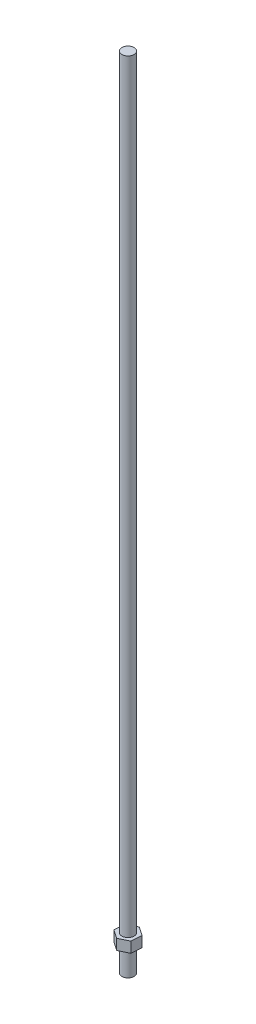
ISO-10303-21;
HEADER;
FILE_DESCRIPTION(('STEP AP214'),'2;1');
FILE_NAME('part.step','',(''),(''),'','','');
FILE_SCHEMA(('AUTOMOTIVE_DESIGN { 1 0 10303 214 1 1 1 1 }'));
ENDSEC;
DATA;
#1=APPLICATION_CONTEXT('core data for automotive mechanical design processes');
#2=APPLICATION_PROTOCOL_DEFINITION('international standard','automotive_design',2000,#1);
#3=PRODUCT_CONTEXT('',#1,'mechanical');
#4=PRODUCT('Part','Part','',(#3));
#5=PRODUCT_RELATED_PRODUCT_CATEGORY('part','',(#4));
#6=PRODUCT_DEFINITION_FORMATION('','',#4);
#7=PRODUCT_DEFINITION_CONTEXT('part definition',#1,'design');
#8=PRODUCT_DEFINITION('design','',#6,#7);
#9=PRODUCT_DEFINITION_SHAPE('','',#8);
#10=(LENGTH_UNIT() NAMED_UNIT(*) SI_UNIT(.MILLI.,.METRE.));
#11=(NAMED_UNIT(*) PLANE_ANGLE_UNIT() SI_UNIT($,.RADIAN.));
#12=(NAMED_UNIT(*) SI_UNIT($,.STERADIAN.) SOLID_ANGLE_UNIT());
#13=UNCERTAINTY_MEASURE_WITH_UNIT(LENGTH_MEASURE(1.E-05),#10,'distance_accuracy_value','');
#14=(GEOMETRIC_REPRESENTATION_CONTEXT(3) GLOBAL_UNCERTAINTY_ASSIGNED_CONTEXT((#13)) GLOBAL_UNIT_ASSIGNED_CONTEXT((#10,
#11,#12)) REPRESENTATION_CONTEXT('',''));
#15=CARTESIAN_POINT('',(0.,0.,0.));
#16=DIRECTION('',(0.,0.,1.));
#17=DIRECTION('',(1.,0.,0.));
#18=AXIS2_PLACEMENT_3D('',#15,#16,#17);
#19=CARTESIAN_POINT('',(0.,831.85,0.));
#20=DIRECTION('',(0.,-1.,0.));
#21=DIRECTION('',(0.,0.,-1.));
#22=AXIS2_PLACEMENT_3D('',#19,#20,#21);
#23=CYLINDRICAL_SURFACE('',#22,6.35);
#24=CARTESIAN_POINT('',(0.,36.449,0.));
#25=DIRECTION('',(0.,1.,0.));
#26=DIRECTION('',(0.,0.,1.));
#27=AXIS2_PLACEMENT_3D('',#24,#25,#26);
#28=CIRCLE('',#27,6.35);
#29=CARTESIAN_POINT('',(0.,36.449,6.35));
#30=VERTEX_POINT('',#29);
#31=EDGE_CURVE('E35',#30,#30,#28,.T.);
#32=ORIENTED_EDGE('',*,*,#31,.T.);
#33=EDGE_LOOP('',(#32));
#34=FACE_BOUND('',#33,.T.);
#35=CARTESIAN_POINT('',(0.,831.85,0.));
#36=DIRECTION('',(0.,1.,0.));
#37=DIRECTION('',(0.,0.,1.));
#38=AXIS2_PLACEMENT_3D('',#35,#36,#37);
#39=CIRCLE('',#38,6.35);
#40=CARTESIAN_POINT('',(0.,831.85,6.35));
#41=VERTEX_POINT('',#40);
#42=EDGE_CURVE('E41',#41,#41,#39,.T.);
#43=ORIENTED_EDGE('',*,*,#42,.F.);
#44=EDGE_LOOP('',(#43));
#45=FACE_BOUND('',#44,.T.);
#46=ADVANCED_FACE('F32',(#34,#45),#23,.T.);
#47=CARTESIAN_POINT('',(0.,831.85,0.));
#48=DIRECTION('',(0.,1.,0.));
#49=DIRECTION('',(0.,0.,1.));
#50=AXIS2_PLACEMENT_3D('',#47,#48,#49);
#51=PLANE('',#50);
#52=ORIENTED_EDGE('',*,*,#42,.T.);
#53=EDGE_LOOP('',(#52));
#54=FACE_BOUND('',#53,.T.);
#55=ADVANCED_FACE('F150',(#54),#51,.T.);
#56=CARTESIAN_POINT('',(0.,36.449,0.));
#57=DIRECTION('',(0.,1.,0.));
#58=DIRECTION('',(0.,0.,1.));
#59=AXIS2_PLACEMENT_3D('',#56,#57,#58);
#60=PLANE('',#59);
#61=DIRECTION('',(0.0679923661634542,0.,-0.99768584140675));
#62=VECTOR('',#61,1.);
#63=CARTESIAN_POINT('',(9.12904985050717,36.449,6.1341624389117));
#64=LINE('',#63,#62);
#65=CARTESIAN_POINT('',(9.12904985050717,36.449,6.1341624389117));
#66=VERTEX_POINT('',#65);
#67=CARTESIAN_POINT('',(9.87686542829142,36.449,-4.83890786349789));
#68=VERTEX_POINT('',#67);
#69=EDGE_CURVE('E129',#66,#68,#64,.T.);
#70=ORIENTED_EDGE('',*,*,#69,.T.);
#71=DIRECTION('',(-0.830025100572571,0.,-0.55772603706434));
#72=VECTOR('',#71,1.);
#73=CARTESIAN_POINT('',(9.87686542829142,36.449,-4.83890786349789));
#74=LINE('',#73,#72);
#75=CARTESIAN_POINT('',(0.747815577784257,36.449,-10.9730703024096));
#76=VERTEX_POINT('',#75);
#77=EDGE_CURVE('E87',#68,#76,#74,.T.);
#78=ORIENTED_EDGE('',*,*,#77,.T.);
#79=DIRECTION('',(-0.898017466736025,0.,0.43995980434241));
#80=VECTOR('',#79,1.);
#81=CARTESIAN_POINT('',(0.747815577784257,36.449,-10.9730703024096));
#82=LINE('',#81,#80);
#83=CARTESIAN_POINT('',(-9.12904985050717,36.449,-6.1341624389117));
#84=VERTEX_POINT('',#83);
#85=EDGE_CURVE('E101',#76,#84,#82,.T.);
#86=ORIENTED_EDGE('',*,*,#85,.T.);
#87=DIRECTION('',(-0.0679923661634545,0.,0.99768584140675));
#88=VECTOR('',#87,1.);
#89=CARTESIAN_POINT('',(-9.12904985050717,36.449,-6.1341624389117));
#90=LINE('',#89,#88);
#91=CARTESIAN_POINT('',(-9.87686542829143,36.449,4.83890786349789));
#92=VERTEX_POINT('',#91);
#93=EDGE_CURVE('E94',#84,#92,#90,.T.);
#94=ORIENTED_EDGE('',*,*,#93,.T.);
#95=DIRECTION('',(0.830025100572571,0.,0.55772603706434));
#96=VECTOR('',#95,1.);
#97=CARTESIAN_POINT('',(-9.87686542829143,36.449,4.83890786349789));
#98=LINE('',#97,#96);
#99=CARTESIAN_POINT('',(-0.747815577784261,36.449,10.9730703024096));
#100=VERTEX_POINT('',#99);
#101=EDGE_CURVE('E99',#92,#100,#98,.T.);
#102=ORIENTED_EDGE('',*,*,#101,.T.);
#103=DIRECTION('',(0.898017466736025,0.,-0.43995980434241));
#104=VECTOR('',#103,1.);
#105=CARTESIAN_POINT('',(-0.747815577784261,36.449,10.9730703024096));
#106=LINE('',#105,#104);
#107=EDGE_CURVE('E49',#100,#66,#106,.T.);
#108=ORIENTED_EDGE('',*,*,#107,.T.);
#109=EDGE_LOOP('',(#70,#78,#86,#94,#102,#108));
#110=FACE_BOUND('',#109,.T.);
#111=ORIENTED_EDGE('',*,*,#31,.F.);
#112=EDGE_LOOP('',(#111));
#113=FACE_BOUND('',#112,.T.);
#114=ADVANCED_FACE('F96',(#110,#113),#60,.T.);
#115=CARTESIAN_POINT('',(0.,25.4,0.));
#116=DIRECTION('',(0.,1.,0.));
#117=DIRECTION('',(0.,0.,1.));
#118=AXIS2_PLACEMENT_3D('',#115,#116,#117);
#119=PLANE('',#118);
#120=DIRECTION('',(0.0679923661634542,0.,-0.99768584140675));
#121=VECTOR('',#120,1.);
#122=CARTESIAN_POINT('',(9.12904985050717,25.4,6.1341624389117));
#123=LINE('',#122,#121);
#124=CARTESIAN_POINT('',(9.12904985050717,25.4,6.1341624389117));
#125=VERTEX_POINT('',#124);
#126=CARTESIAN_POINT('',(9.87686542829142,25.4,-4.83890786349789));
#127=VERTEX_POINT('',#126);
#128=EDGE_CURVE('E119',#125,#127,#123,.T.);
#129=ORIENTED_EDGE('',*,*,#128,.F.);
#130=DIRECTION('',(0.898017466736025,0.,-0.43995980434241));
#131=VECTOR('',#130,1.);
#132=CARTESIAN_POINT('',(-0.747815577784261,25.4,10.9730703024096));
#133=LINE('',#132,#131);
#134=CARTESIAN_POINT('',(-0.747815577784261,25.4,10.9730703024096));
#135=VERTEX_POINT('',#134);
#136=EDGE_CURVE('E78',#135,#125,#133,.T.);
#137=ORIENTED_EDGE('',*,*,#136,.F.);
#138=DIRECTION('',(0.830025100572571,0.,0.55772603706434));
#139=VECTOR('',#138,1.);
#140=CARTESIAN_POINT('',(-9.87686542829143,25.4,4.83890786349789));
#141=LINE('',#140,#139);
#142=CARTESIAN_POINT('',(-9.87686542829143,25.4,4.83890786349789));
#143=VERTEX_POINT('',#142);
#144=EDGE_CURVE('E72',#143,#135,#141,.T.);
#145=ORIENTED_EDGE('',*,*,#144,.F.);
#146=DIRECTION('',(-0.0679923661634545,0.,0.99768584140675));
#147=VECTOR('',#146,1.);
#148=CARTESIAN_POINT('',(-9.12904985050717,25.4,-6.1341624389117));
#149=LINE('',#148,#147);
#150=CARTESIAN_POINT('',(-9.12904985050717,25.4,-6.1341624389117));
#151=VERTEX_POINT('',#150);
#152=EDGE_CURVE('E109',#151,#143,#149,.T.);
#153=ORIENTED_EDGE('',*,*,#152,.F.);
#154=DIRECTION('',(-0.898017466736025,0.,0.43995980434241));
#155=VECTOR('',#154,1.);
#156=CARTESIAN_POINT('',(0.747815577784257,25.4,-10.9730703024096));
#157=LINE('',#156,#155);
#158=CARTESIAN_POINT('',(0.747815577784257,25.4,-10.9730703024096));
#159=VERTEX_POINT('',#158);
#160=EDGE_CURVE('E124',#159,#151,#157,.T.);
#161=ORIENTED_EDGE('',*,*,#160,.F.);
#162=DIRECTION('',(-0.830025100572571,0.,-0.55772603706434));
#163=VECTOR('',#162,1.);
#164=CARTESIAN_POINT('',(9.87686542829142,25.4,-4.83890786349789));
#165=LINE('',#164,#163);
#166=EDGE_CURVE('E122',#127,#159,#165,.T.);
#167=ORIENTED_EDGE('',*,*,#166,.F.);
#168=EDGE_LOOP('',(#129,#137,#145,#153,#161,#167));
#169=FACE_BOUND('',#168,.T.);
#170=CARTESIAN_POINT('',(0.,25.4,0.));
#171=DIRECTION('',(0.,1.,0.));
#172=DIRECTION('',(0.,0.,1.));
#173=AXIS2_PLACEMENT_3D('',#170,#171,#172);
#174=CIRCLE('',#173,6.35);
#175=CARTESIAN_POINT('',(0.,25.4,6.35));
#176=VERTEX_POINT('',#175);
#177=EDGE_CURVE('E11',#176,#176,#174,.T.);
#178=ORIENTED_EDGE('',*,*,#177,.T.);
#179=EDGE_LOOP('',(#178));
#180=FACE_BOUND('',#179,.T.);
#181=ADVANCED_FACE('F149',(#169,#180),#119,.F.);
#182=CARTESIAN_POINT('',(9.12904985050717,36.449,6.1341624389117));
#183=DIRECTION('',(-0.99768584140675,0.,-0.0679923661634542));
#184=DIRECTION('',(-0.0679923661634542,0.,0.99768584140675));
#185=AXIS2_PLACEMENT_3D('',#182,#183,#184);
#186=PLANE('',#185);
#187=ORIENTED_EDGE('',*,*,#128,.T.);
#188=DIRECTION('',(0.,-1.,0.));
#189=VECTOR('',#188,1.);
#190=CARTESIAN_POINT('',(9.87686542829142,36.449,-4.83890786349789));
#191=LINE('',#190,#189);
#192=EDGE_CURVE('E136',#68,#127,#191,.T.);
#193=ORIENTED_EDGE('',*,*,#192,.F.);
#194=ORIENTED_EDGE('',*,*,#69,.F.);
#195=DIRECTION('',(0.,-1.,0.));
#196=VECTOR('',#195,1.);
#197=CARTESIAN_POINT('',(9.12904985050717,36.449,6.1341624389117));
#198=LINE('',#197,#196);
#199=EDGE_CURVE('E115',#66,#125,#198,.T.);
#200=ORIENTED_EDGE('',*,*,#199,.T.);
#201=EDGE_LOOP('',(#187,#193,#194,#200));
#202=FACE_BOUND('',#201,.T.);
#203=ADVANCED_FACE('F156',(#202),#186,.F.);
#204=CARTESIAN_POINT('',(9.87686542829142,36.449,-4.83890786349789));
#205=DIRECTION('',(-0.55772603706434,0.,0.830025100572571));
#206=DIRECTION('',(0.830025100572571,0.,0.55772603706434));
#207=AXIS2_PLACEMENT_3D('',#204,#205,#206);
#208=PLANE('',#207);
#209=ORIENTED_EDGE('',*,*,#166,.T.);
#210=DIRECTION('',(0.,-1.,0.));
#211=VECTOR('',#210,1.);
#212=CARTESIAN_POINT('',(0.747815577784257,36.449,-10.9730703024096));
#213=LINE('',#212,#211);
#214=EDGE_CURVE('E133',#76,#159,#213,.T.);
#215=ORIENTED_EDGE('',*,*,#214,.F.);
#216=ORIENTED_EDGE('',*,*,#77,.F.);
#217=ORIENTED_EDGE('',*,*,#192,.T.);
#218=EDGE_LOOP('',(#209,#215,#216,#217));
#219=FACE_BOUND('',#218,.T.);
#220=ADVANCED_FACE('F182',(#219),#208,.F.);
#221=CARTESIAN_POINT('',(0.747815577784257,36.449,-10.9730703024096));
#222=DIRECTION('',(0.43995980434241,0.,0.898017466736025));
#223=DIRECTION('',(0.898017466736025,0.,-0.43995980434241));
#224=AXIS2_PLACEMENT_3D('',#221,#222,#223);
#225=PLANE('',#224);
#226=ORIENTED_EDGE('',*,*,#160,.T.);
#227=DIRECTION('',(0.,-1.,0.));
#228=VECTOR('',#227,1.);
#229=CARTESIAN_POINT('',(-9.12904985050717,36.449,-6.1341624389117));
#230=LINE('',#229,#228);
#231=EDGE_CURVE('E110',#84,#151,#230,.T.);
#232=ORIENTED_EDGE('',*,*,#231,.F.);
#233=ORIENTED_EDGE('',*,*,#85,.F.);
#234=ORIENTED_EDGE('',*,*,#214,.T.);
#235=EDGE_LOOP('',(#226,#232,#233,#234));
#236=FACE_BOUND('',#235,.T.);
#237=ADVANCED_FACE('F186',(#236),#225,.F.);
#238=CARTESIAN_POINT('',(-9.12904985050717,36.449,-6.1341624389117));
#239=DIRECTION('',(0.99768584140675,0.,0.0679923661634545));
#240=DIRECTION('',(0.0679923661634545,0.,-0.99768584140675));
#241=AXIS2_PLACEMENT_3D('',#238,#239,#240);
#242=PLANE('',#241);
#243=ORIENTED_EDGE('',*,*,#152,.T.);
#244=DIRECTION('',(0.,-1.,0.));
#245=VECTOR('',#244,1.);
#246=CARTESIAN_POINT('',(-9.87686542829143,36.449,4.83890786349789));
#247=LINE('',#246,#245);
#248=EDGE_CURVE('E106',#92,#143,#247,.T.);
#249=ORIENTED_EDGE('',*,*,#248,.F.);
#250=ORIENTED_EDGE('',*,*,#93,.F.);
#251=ORIENTED_EDGE('',*,*,#231,.T.);
#252=EDGE_LOOP('',(#243,#249,#250,#251));
#253=FACE_BOUND('',#252,.T.);
#254=ADVANCED_FACE('F107',(#253),#242,.F.);
#255=CARTESIAN_POINT('',(-9.87686542829143,36.449,4.83890786349789));
#256=DIRECTION('',(0.55772603706434,0.,-0.830025100572571));
#257=DIRECTION('',(-0.830025100572571,0.,-0.55772603706434));
#258=AXIS2_PLACEMENT_3D('',#255,#256,#257);
#259=PLANE('',#258);
#260=ORIENTED_EDGE('',*,*,#144,.T.);
#261=DIRECTION('',(0.,-1.,0.));
#262=VECTOR('',#261,1.);
#263=CARTESIAN_POINT('',(-0.747815577784261,36.449,10.9730703024096));
#264=LINE('',#263,#262);
#265=EDGE_CURVE('E111',#100,#135,#264,.T.);
#266=ORIENTED_EDGE('',*,*,#265,.F.);
#267=ORIENTED_EDGE('',*,*,#101,.F.);
#268=ORIENTED_EDGE('',*,*,#248,.T.);
#269=EDGE_LOOP('',(#260,#266,#267,#268));
#270=FACE_BOUND('',#269,.T.);
#271=ADVANCED_FACE('F113',(#270),#259,.F.);
#272=CARTESIAN_POINT('',(-0.747815577784261,36.449,10.9730703024096));
#273=DIRECTION('',(-0.43995980434241,0.,-0.898017466736025));
#274=DIRECTION('',(-0.898017466736026,0.,0.43995980434241));
#275=AXIS2_PLACEMENT_3D('',#272,#273,#274);
#276=PLANE('',#275);
#277=ORIENTED_EDGE('',*,*,#136,.T.);
#278=ORIENTED_EDGE('',*,*,#199,.F.);
#279=ORIENTED_EDGE('',*,*,#107,.F.);
#280=ORIENTED_EDGE('',*,*,#265,.T.);
#281=EDGE_LOOP('',(#277,#278,#279,#280));
#282=FACE_BOUND('',#281,.T.);
#283=ADVANCED_FACE('F170',(#282),#276,.F.);
#284=CARTESIAN_POINT('',(0.,0.,0.));
#285=DIRECTION('',(0.,1.,0.));
#286=DIRECTION('',(0.,0.,1.));
#287=AXIS2_PLACEMENT_3D('',#284,#285,#286);
#288=PLANE('',#287);
#289=CARTESIAN_POINT('',(0.,0.,0.));
#290=DIRECTION('',(0.,1.,0.));
#291=DIRECTION('',(0.,0.,1.));
#292=AXIS2_PLACEMENT_3D('',#289,#290,#291);
#293=CIRCLE('',#292,6.35);
#294=CARTESIAN_POINT('',(0.,0.,6.35));
#295=VERTEX_POINT('',#294);
#296=EDGE_CURVE('E140',#295,#295,#293,.T.);
#297=ORIENTED_EDGE('',*,*,#296,.F.);
#298=EDGE_LOOP('',(#297));
#299=FACE_BOUND('',#298,.T.);
#300=ADVANCED_FACE('F166',(#299),#288,.F.);
#301=ORIENTED_EDGE('',*,*,#296,.T.);
#302=EDGE_LOOP('',(#301));
#303=FACE_BOUND('',#302,.T.);
#304=ORIENTED_EDGE('',*,*,#177,.F.);
#305=EDGE_LOOP('',(#304));
#306=FACE_BOUND('',#305,.T.);
#307=ADVANCED_FACE('F162',(#303,#306),#23,.T.);
#308=CLOSED_SHELL('',(#46,#55,#114,#181,#203,#220,#237,#254,#271,#283,#300,#307));
#309=MANIFOLD_SOLID_BREP('B2',#308);
#310=ADVANCED_BREP_SHAPE_REPRESENTATION('',(#18,#309),#14);
#311=SHAPE_DEFINITION_REPRESENTATION(#9,#310);
ENDSEC;
END-ISO-10303-21;
